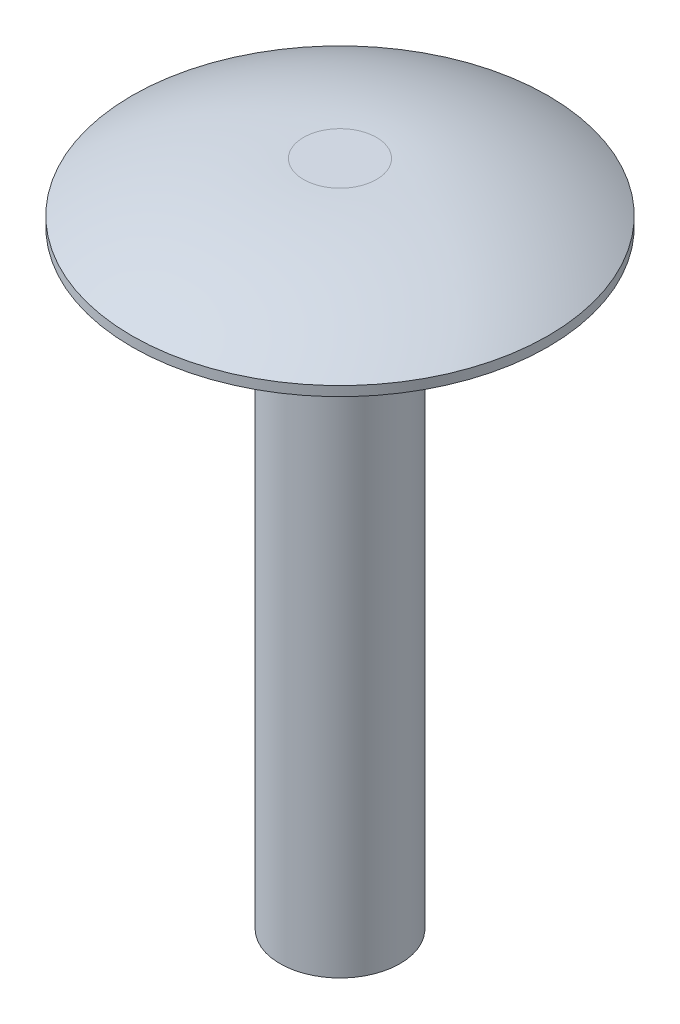
ISO-10303-21;
HEADER;
FILE_DESCRIPTION(('STEP AP214'),'2;1');
FILE_NAME('part.step','',(''),(''),'','','');
FILE_SCHEMA(('AUTOMOTIVE_DESIGN { 1 0 10303 214 1 1 1 1 }'));
ENDSEC;
DATA;
#1=APPLICATION_CONTEXT('core data for automotive mechanical design processes');
#2=APPLICATION_PROTOCOL_DEFINITION('international standard','automotive_design',2000,#1);
#3=PRODUCT_CONTEXT('',#1,'mechanical');
#4=PRODUCT('Part','Part','',(#3));
#5=PRODUCT_RELATED_PRODUCT_CATEGORY('part','',(#4));
#6=PRODUCT_DEFINITION_FORMATION('','',#4);
#7=PRODUCT_DEFINITION_CONTEXT('part definition',#1,'design');
#8=PRODUCT_DEFINITION('design','',#6,#7);
#9=PRODUCT_DEFINITION_SHAPE('','',#8);
#10=(LENGTH_UNIT() NAMED_UNIT(*) SI_UNIT(.MILLI.,.METRE.));
#11=(NAMED_UNIT(*) PLANE_ANGLE_UNIT() SI_UNIT($,.RADIAN.));
#12=(NAMED_UNIT(*) SI_UNIT($,.STERADIAN.) SOLID_ANGLE_UNIT());
#13=UNCERTAINTY_MEASURE_WITH_UNIT(LENGTH_MEASURE(1.E-05),#10,'distance_accuracy_value','');
#14=(GEOMETRIC_REPRESENTATION_CONTEXT(3) GLOBAL_UNCERTAINTY_ASSIGNED_CONTEXT((#13)) GLOBAL_UNIT_ASSIGNED_CONTEXT((#10,
#11,#12)) REPRESENTATION_CONTEXT('',''));
#15=CARTESIAN_POINT('',(0.,0.,0.));
#16=DIRECTION('',(0.,0.,1.));
#17=DIRECTION('',(1.,0.,0.));
#18=AXIS2_PLACEMENT_3D('',#15,#16,#17);
#19=CARTESIAN_POINT('',(0.,0.,0.));
#20=DIRECTION('',(0.,1.,0.));
#21=DIRECTION('',(-1.,0.,0.));
#22=AXIS2_PLACEMENT_3D('',#19,#20,#21);
#23=PLANE('',#22);
#24=CARTESIAN_POINT('',(0.,0.,0.));
#25=DIRECTION('',(0.,-1.,0.));
#26=DIRECTION('',(1.,0.,0.));
#27=AXIS2_PLACEMENT_3D('',#24,#25,#26);
#28=CIRCLE('',#27,2.38125);
#29=CARTESIAN_POINT('',(2.38125,0.,0.));
#30=VERTEX_POINT('',#29);
#31=EDGE_CURVE('E10',#30,#30,#28,.T.);
#32=ORIENTED_EDGE('',*,*,#31,.T.);
#33=EDGE_LOOP('',(#32));
#34=FACE_BOUND('',#33,.T.);
#35=ADVANCED_FACE('F35',(#34),#23,.F.);
#36=CARTESIAN_POINT('',(0.,0.,0.));
#37=DIRECTION('',(0.,-1.,0.));
#38=DIRECTION('',(1.,0.,0.));
#39=AXIS2_PLACEMENT_3D('',#36,#37,#38);
#40=CYLINDRICAL_SURFACE('',#39,2.38125);
#41=ORIENTED_EDGE('',*,*,#31,.F.);
#42=EDGE_LOOP('',(#41));
#43=FACE_BOUND('',#42,.T.);
#44=CARTESIAN_POINT('',(0.,24.13,0.));
#45=DIRECTION('',(0.,-1.,0.));
#46=DIRECTION('',(1.,0.,0.));
#47=AXIS2_PLACEMENT_3D('',#44,#45,#46);
#48=CIRCLE('',#47,2.38125);
#49=CARTESIAN_POINT('',(2.38125,24.13,0.));
#50=VERTEX_POINT('',#49);
#51=EDGE_CURVE('E41',#50,#50,#48,.T.);
#52=ORIENTED_EDGE('',*,*,#51,.T.);
#53=EDGE_LOOP('',(#52));
#54=FACE_BOUND('',#53,.T.);
#55=ADVANCED_FACE('F70',(#43,#54),#40,.T.);
#56=CARTESIAN_POINT('',(-2.38125,24.13,0.));
#57=DIRECTION('',(0.,1.,0.));
#58=DIRECTION('',(-1.,0.,0.));
#59=AXIS2_PLACEMENT_3D('',#56,#57,#58);
#60=PLANE('',#59);
#61=ORIENTED_EDGE('',*,*,#51,.F.);
#62=EDGE_LOOP('',(#61));
#63=FACE_BOUND('',#62,.T.);
#64=CARTESIAN_POINT('',(0.,24.13,0.));
#65=DIRECTION('',(0.,-1.,0.));
#66=DIRECTION('',(1.,0.,0.));
#67=AXIS2_PLACEMENT_3D('',#64,#65,#66);
#68=CIRCLE('',#67,8.255);
#69=CARTESIAN_POINT('',(8.255,24.13,0.));
#70=VERTEX_POINT('',#69);
#71=EDGE_CURVE('E45',#70,#70,#68,.T.);
#72=ORIENTED_EDGE('',*,*,#71,.T.);
#73=EDGE_LOOP('',(#72));
#74=FACE_BOUND('',#73,.T.);
#75=ADVANCED_FACE('F74',(#63,#74),#60,.F.);
#76=CARTESIAN_POINT('',(0.,0.,0.));
#77=DIRECTION('',(0.,-1.,0.));
#78=DIRECTION('',(1.,0.,0.));
#79=AXIS2_PLACEMENT_3D('',#76,#77,#78);
#80=CYLINDRICAL_SURFACE('',#79,8.255);
#81=ORIENTED_EDGE('',*,*,#71,.F.);
#82=EDGE_LOOP('',(#81));
#83=FACE_BOUND('',#82,.T.);
#84=CARTESIAN_POINT('',(0.,24.511,0.));
#85=DIRECTION('',(0.,-1.,0.));
#86=DIRECTION('',(1.,0.,0.));
#87=AXIS2_PLACEMENT_3D('',#84,#85,#86);
#88=CIRCLE('',#87,8.255);
#89=CARTESIAN_POINT('',(8.255,24.511,0.));
#90=VERTEX_POINT('',#89);
#91=EDGE_CURVE('E49',#90,#90,#88,.T.);
#92=ORIENTED_EDGE('',*,*,#91,.T.);
#93=EDGE_LOOP('',(#92));
#94=FACE_BOUND('',#93,.T.);
#95=ADVANCED_FACE('F66',(#83,#94),#80,.T.);
#96=CARTESIAN_POINT('',(0.,13.7253816129032,0.));
#97=DIRECTION('',(0.,-1.,0.));
#98=DIRECTION('',(1.,0.,0.));
#99=AXIS2_PLACEMENT_3D('',#96,#97,#98);
#100=DEGENERATE_TOROIDAL_SURFACE('',#99,1.4478,12.7541183870968,.T.);
#101=ORIENTED_EDGE('',*,*,#91,.F.);
#102=EDGE_LOOP('',(#101));
#103=FACE_BOUND('',#102,.T.);
#104=CARTESIAN_POINT('',(0.,26.4795,0.));
#105=DIRECTION('',(0.,-1.,0.));
#106=DIRECTION('',(1.,0.,0.));
#107=AXIS2_PLACEMENT_3D('',#104,#105,#106);
#108=CIRCLE('',#107,1.4478);
#109=CARTESIAN_POINT('',(1.4478,26.4795,0.));
#110=VERTEX_POINT('',#109);
#111=EDGE_CURVE('E54',#110,#110,#108,.T.);
#112=ORIENTED_EDGE('',*,*,#111,.T.);
#113=EDGE_LOOP('',(#112));
#114=FACE_BOUND('',#113,.T.);
#115=ADVANCED_FACE('F58',(#103,#114),#100,.T.);
#116=CARTESIAN_POINT('',(-1.4478,26.4795,0.));
#117=DIRECTION('',(0.,-1.,0.));
#118=DIRECTION('',(1.,0.,0.));
#119=AXIS2_PLACEMENT_3D('',#116,#117,#118);
#120=PLANE('',#119);
#121=ORIENTED_EDGE('',*,*,#111,.F.);
#122=EDGE_LOOP('',(#121));
#123=FACE_BOUND('',#122,.T.);
#124=ADVANCED_FACE('F60',(#123),#120,.F.);
#125=CLOSED_SHELL('',(#35,#55,#75,#95,#115,#124));
#126=MANIFOLD_SOLID_BREP('B2',#125);
#127=ADVANCED_BREP_SHAPE_REPRESENTATION('',(#18,#126),#14);
#128=SHAPE_DEFINITION_REPRESENTATION(#9,#127);
ENDSEC;
END-ISO-10303-21;
